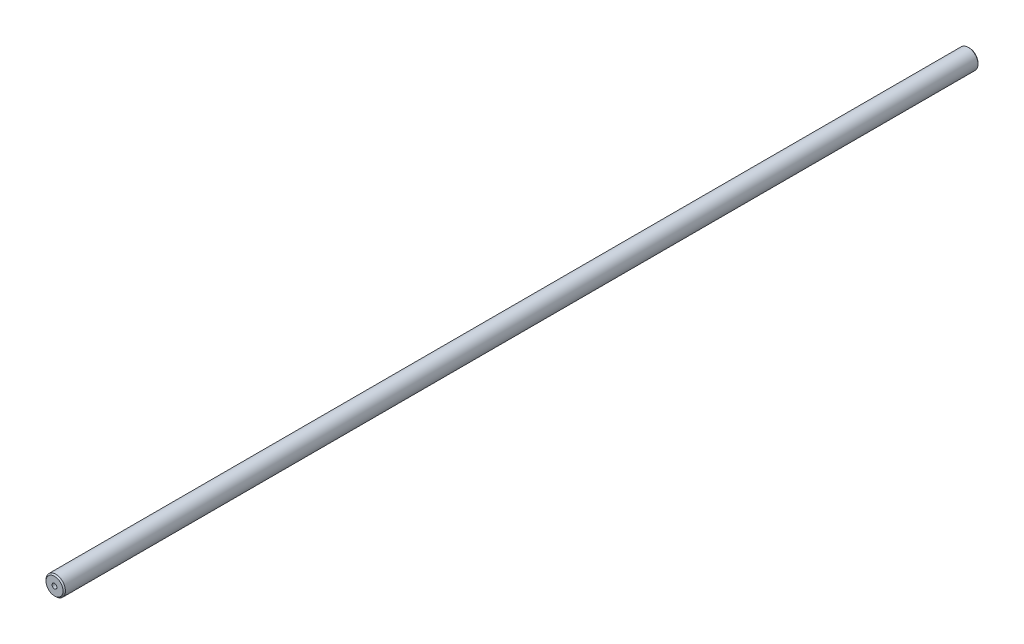
ISO-10303-21;
HEADER;
FILE_DESCRIPTION(('STEP AP214'),'2;1');
FILE_NAME('part.step','',(''),(''),'','','');
FILE_SCHEMA(('AUTOMOTIVE_DESIGN { 1 0 10303 214 1 1 1 1 }'));
ENDSEC;
DATA;
#1=APPLICATION_CONTEXT('core data for automotive mechanical design processes');
#2=APPLICATION_PROTOCOL_DEFINITION('international standard','automotive_design',2000,#1);
#3=PRODUCT_CONTEXT('',#1,'mechanical');
#4=PRODUCT('Part','Part','',(#3));
#5=PRODUCT_RELATED_PRODUCT_CATEGORY('part','',(#4));
#6=PRODUCT_DEFINITION_FORMATION('','',#4);
#7=PRODUCT_DEFINITION_CONTEXT('part definition',#1,'design');
#8=PRODUCT_DEFINITION('design','',#6,#7);
#9=PRODUCT_DEFINITION_SHAPE('','',#8);
#10=(LENGTH_UNIT() NAMED_UNIT(*) SI_UNIT(.MILLI.,.METRE.));
#11=(NAMED_UNIT(*) PLANE_ANGLE_UNIT() SI_UNIT($,.RADIAN.));
#12=(NAMED_UNIT(*) SI_UNIT($,.STERADIAN.) SOLID_ANGLE_UNIT());
#13=UNCERTAINTY_MEASURE_WITH_UNIT(LENGTH_MEASURE(1.E-05),#10,'distance_accuracy_value','');
#14=(GEOMETRIC_REPRESENTATION_CONTEXT(3) GLOBAL_UNCERTAINTY_ASSIGNED_CONTEXT((#13)) GLOBAL_UNIT_ASSIGNED_CONTEXT((#10,
#11,#12)) REPRESENTATION_CONTEXT('',''));
#15=CARTESIAN_POINT('',(0.,0.,0.));
#16=DIRECTION('',(0.,0.,1.));
#17=DIRECTION('',(1.,0.,0.));
#18=AXIS2_PLACEMENT_3D('',#15,#16,#17);
#19=CARTESIAN_POINT('',(0.,0.,376.));
#20=DIRECTION('',(0.,0.,-1.));
#21=DIRECTION('',(-1.,0.,0.));
#22=AXIS2_PLACEMENT_3D('',#19,#20,#21);
#23=CYLINDRICAL_SURFACE('',#22,4.);
#24=CARTESIAN_POINT('',(0.,0.,0.5));
#25=DIRECTION('',(0.,0.,1.));
#26=DIRECTION('',(1.,0.,0.));
#27=AXIS2_PLACEMENT_3D('',#24,#25,#26);
#28=CIRCLE('',#27,4.);
#29=CARTESIAN_POINT('',(4.,0.,0.5));
#30=VERTEX_POINT('',#29);
#31=EDGE_CURVE('E54',#30,#30,#28,.T.);
#32=ORIENTED_EDGE('',*,*,#31,.T.);
#33=EDGE_LOOP('',(#32));
#34=FACE_BOUND('',#33,.T.);
#35=CARTESIAN_POINT('',(0.,0.,375.5));
#36=DIRECTION('',(0.,0.,1.));
#37=DIRECTION('',(1.,0.,0.));
#38=AXIS2_PLACEMENT_3D('',#35,#36,#37);
#39=CIRCLE('',#38,4.);
#40=CARTESIAN_POINT('',(4.,0.,375.5));
#41=VERTEX_POINT('',#40);
#42=EDGE_CURVE('E58',#41,#41,#39,.F.);
#43=ORIENTED_EDGE('',*,*,#42,.T.);
#44=EDGE_LOOP('',(#43));
#45=FACE_BOUND('',#44,.T.);
#46=ADVANCED_FACE('F43',(#34,#45),#23,.T.);
#47=CARTESIAN_POINT('',(0.,0.,376.));
#48=DIRECTION('',(0.,0.,1.));
#49=DIRECTION('',(1.,0.,0.));
#50=AXIS2_PLACEMENT_3D('',#47,#48,#49);
#51=PLANE('',#50);
#52=CARTESIAN_POINT('',(0.,0.,376.));
#53=DIRECTION('',(0.,0.,1.));
#54=DIRECTION('',(1.,0.,0.));
#55=AXIS2_PLACEMENT_3D('',#52,#53,#54);
#56=CIRCLE('',#55,3.50000000000011);
#57=CARTESIAN_POINT('',(3.50000000000011,0.,376.));
#58=VERTEX_POINT('',#57);
#59=EDGE_CURVE('E12',#58,#58,#56,.T.);
#60=ORIENTED_EDGE('',*,*,#59,.T.);
#61=EDGE_LOOP('',(#60));
#62=FACE_BOUND('',#61,.T.);
#63=CARTESIAN_POINT('',(0.,0.,376.));
#64=DIRECTION('',(0.,0.,1.));
#65=DIRECTION('',(1.,0.,0.));
#66=AXIS2_PLACEMENT_3D('',#63,#64,#65);
#67=CIRCLE('',#66,1.);
#68=CARTESIAN_POINT('',(1.,0.,376.));
#69=VERTEX_POINT('',#68);
#70=EDGE_CURVE('E64',#69,#69,#67,.T.);
#71=ORIENTED_EDGE('',*,*,#70,.F.);
#72=EDGE_LOOP('',(#71));
#73=FACE_BOUND('',#72,.T.);
#74=ADVANCED_FACE('F79',(#62,#73),#51,.T.);
#75=CARTESIAN_POINT('',(0.,0.,0.));
#76=DIRECTION('',(0.,0.,1.));
#77=DIRECTION('',(1.,0.,0.));
#78=AXIS2_PLACEMENT_3D('',#75,#76,#77);
#79=PLANE('',#78);
#80=CARTESIAN_POINT('',(0.,0.,0.));
#81=DIRECTION('',(0.,0.,1.));
#82=DIRECTION('',(1.,0.,0.));
#83=AXIS2_PLACEMENT_3D('',#80,#81,#82);
#84=CIRCLE('',#83,3.5);
#85=CARTESIAN_POINT('',(3.5,0.,0.));
#86=VERTEX_POINT('',#85);
#87=EDGE_CURVE('E50',#86,#86,#84,.F.);
#88=ORIENTED_EDGE('',*,*,#87,.T.);
#89=EDGE_LOOP('',(#88));
#90=FACE_BOUND('',#89,.T.);
#91=ADVANCED_FACE('F75',(#90),#79,.F.);
#92=CARTESIAN_POINT('',(0.,0.,366.));
#93=DIRECTION('',(0.,0.,1.));
#94=DIRECTION('',(1.,0.,0.));
#95=AXIS2_PLACEMENT_3D('',#92,#93,#94);
#96=CYLINDRICAL_SURFACE('',#95,1.);
#97=CARTESIAN_POINT('',(0.,0.,366.));
#98=DIRECTION('',(0.,0.,1.));
#99=DIRECTION('',(1.,0.,0.));
#100=AXIS2_PLACEMENT_3D('',#97,#98,#99);
#101=CIRCLE('',#100,1.);
#102=CARTESIAN_POINT('',(1.,0.,366.));
#103=VERTEX_POINT('',#102);
#104=EDGE_CURVE('E63',#103,#103,#101,.T.);
#105=ORIENTED_EDGE('',*,*,#104,.F.);
#106=EDGE_LOOP('',(#105));
#107=FACE_BOUND('',#106,.T.);
#108=ORIENTED_EDGE('',*,*,#70,.T.);
#109=EDGE_LOOP('',(#108));
#110=FACE_BOUND('',#109,.T.);
#111=ADVANCED_FACE('F72',(#107,#110),#96,.F.);
#112=CARTESIAN_POINT('',(0.,0.,366.));
#113=DIRECTION('',(0.,0.,1.));
#114=DIRECTION('',(1.,0.,0.));
#115=AXIS2_PLACEMENT_3D('',#112,#113,#114);
#116=PLANE('',#115);
#117=ORIENTED_EDGE('',*,*,#104,.T.);
#118=EDGE_LOOP('',(#117));
#119=FACE_BOUND('',#118,.T.);
#120=ADVANCED_FACE('F70',(#119),#116,.T.);
#121=CARTESIAN_POINT('',(0.,0.,0.5));
#122=DIRECTION('',(0.,0.,1.));
#123=DIRECTION('',(1.,0.,0.));
#124=AXIS2_PLACEMENT_3D('',#121,#122,#123);
#125=CONICAL_SURFACE('',#124,4.,0.785398163397445);
#126=ORIENTED_EDGE('',*,*,#87,.F.);
#127=EDGE_LOOP('',(#126));
#128=FACE_BOUND('',#127,.T.);
#129=ORIENTED_EDGE('',*,*,#31,.F.);
#130=EDGE_LOOP('',(#129));
#131=FACE_BOUND('',#130,.T.);
#132=ADVANCED_FACE('F90',(#128,#131),#125,.T.);
#133=CARTESIAN_POINT('',(0.,0.,376.));
#134=DIRECTION('',(0.,0.,-1.));
#135=DIRECTION('',(-1.,0.,0.));
#136=AXIS2_PLACEMENT_3D('',#133,#134,#135);
#137=CONICAL_SURFACE('',#136,3.50000000000011,0.785398163397445);
#138=ORIENTED_EDGE('',*,*,#42,.F.);
#139=EDGE_LOOP('',(#138));
#140=FACE_BOUND('',#139,.T.);
#141=ORIENTED_EDGE('',*,*,#59,.F.);
#142=EDGE_LOOP('',(#141));
#143=FACE_BOUND('',#142,.T.);
#144=ADVANCED_FACE('F45',(#140,#143),#137,.T.);
#145=CLOSED_SHELL('',(#46,#74,#91,#111,#120,#132,#144));
#146=MANIFOLD_SOLID_BREP('B2',#145);
#147=ADVANCED_BREP_SHAPE_REPRESENTATION('',(#18,#146),#14);
#148=SHAPE_DEFINITION_REPRESENTATION(#9,#147);
ENDSEC;
END-ISO-10303-21;
